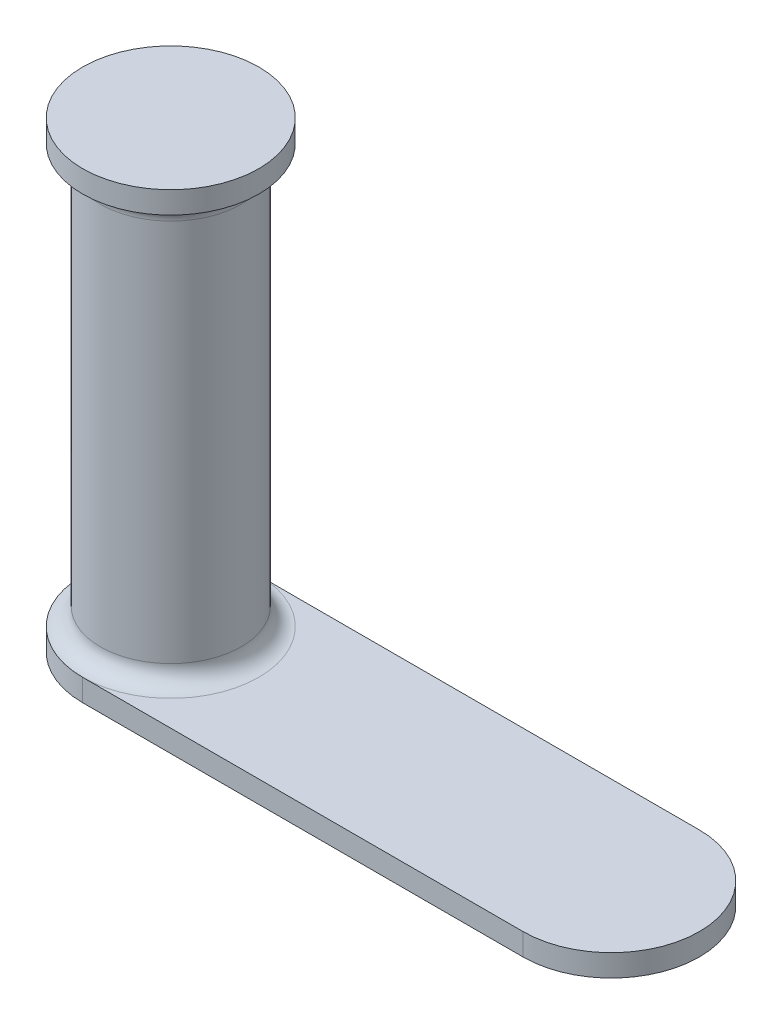
ISO-10303-21;
HEADER;
FILE_DESCRIPTION(('STEP AP214'),'2;1');
FILE_NAME('part.step','',(''),(''),'','','');
FILE_SCHEMA(('AUTOMOTIVE_DESIGN { 1 0 10303 214 1 1 1 1 }'));
ENDSEC;
DATA;
#1=APPLICATION_CONTEXT('core data for automotive mechanical design processes');
#2=APPLICATION_PROTOCOL_DEFINITION('international standard','automotive_design',2000,#1);
#3=PRODUCT_CONTEXT('',#1,'mechanical');
#4=PRODUCT('Part','Part','',(#3));
#5=PRODUCT_RELATED_PRODUCT_CATEGORY('part','',(#4));
#6=PRODUCT_DEFINITION_FORMATION('','',#4);
#7=PRODUCT_DEFINITION_CONTEXT('part definition',#1,'design');
#8=PRODUCT_DEFINITION('design','',#6,#7);
#9=PRODUCT_DEFINITION_SHAPE('','',#8);
#10=(LENGTH_UNIT() NAMED_UNIT(*) SI_UNIT(.MILLI.,.METRE.));
#11=(NAMED_UNIT(*) PLANE_ANGLE_UNIT() SI_UNIT($,.RADIAN.));
#12=(NAMED_UNIT(*) SI_UNIT($,.STERADIAN.) SOLID_ANGLE_UNIT());
#13=UNCERTAINTY_MEASURE_WITH_UNIT(LENGTH_MEASURE(1.E-05),#10,'distance_accuracy_value','');
#14=(GEOMETRIC_REPRESENTATION_CONTEXT(3) GLOBAL_UNCERTAINTY_ASSIGNED_CONTEXT((#13)) GLOBAL_UNIT_ASSIGNED_CONTEXT((#10,
#11,#12)) REPRESENTATION_CONTEXT('',''));
#15=CARTESIAN_POINT('',(0.,0.,0.));
#16=DIRECTION('',(0.,0.,1.));
#17=DIRECTION('',(1.,0.,0.));
#18=AXIS2_PLACEMENT_3D('',#15,#16,#17);
#19=CARTESIAN_POINT('',(0.,60.1846850325902,0.));
#20=DIRECTION('',(0.,-1.,0.));
#21=DIRECTION('',(1.,0.,0.));
#22=AXIS2_PLACEMENT_3D('',#19,#20,#21);
#23=PLANE('',#22);
#24=CARTESIAN_POINT('',(0.,60.1846850325902,0.));
#25=DIRECTION('',(0.,1.,0.));
#26=DIRECTION('',(-1.,0.,0.));
#27=AXIS2_PLACEMENT_3D('',#24,#25,#26);
#28=CIRCLE('',#27,20.);
#29=CARTESIAN_POINT('',(-20.,60.1846850325902,0.));
#30=VERTEX_POINT('',#29);
#31=EDGE_CURVE('E106',#30,#30,#28,.T.);
#32=ORIENTED_EDGE('',*,*,#31,.T.);
#33=EDGE_LOOP('',(#32));
#34=FACE_BOUND('',#33,.T.);
#35=ADVANCED_FACE('F31',(#34),#23,.F.);
#36=CARTESIAN_POINT('',(0.,-35.8153149674098,0.));
#37=DIRECTION('',(0.,1.,0.));
#38=DIRECTION('',(-1.,0.,0.));
#39=AXIS2_PLACEMENT_3D('',#36,#37,#38);
#40=TOROIDAL_SURFACE('',#39,20.,4.);
#41=CARTESIAN_POINT('',(0.,-35.8153149674098,0.));
#42=DIRECTION('',(0.,1.,0.));
#43=DIRECTION('',(-1.,0.,0.));
#44=AXIS2_PLACEMENT_3D('',#41,#42,#43);
#45=CIRCLE('',#44,16.);
#46=CARTESIAN_POINT('',(-16.,-35.8153149674098,0.));
#47=VERTEX_POINT('',#46);
#48=EDGE_CURVE('E38',#47,#47,#45,.T.);
#49=ORIENTED_EDGE('',*,*,#48,.F.);
#50=EDGE_LOOP('',(#49));
#51=FACE_BOUND('',#50,.T.);
#52=CARTESIAN_POINT('',(0.,-39.8153149674098,0.));
#53=DIRECTION('',(0.,1.,0.));
#54=DIRECTION('',(-1.,0.,0.));
#55=AXIS2_PLACEMENT_3D('',#52,#53,#54);
#56=CIRCLE('',#55,20.);
#57=CARTESIAN_POINT('',(0.,-39.8153149674098,20.));
#58=VERTEX_POINT('',#57);
#59=CARTESIAN_POINT('',(0.,-39.8153149674098,-20.));
#60=VERTEX_POINT('',#59);
#61=EDGE_CURVE('E11',#58,#60,#56,.T.);
#62=ORIENTED_EDGE('',*,*,#61,.T.);
#63=CARTESIAN_POINT('',(0.,-39.8153149674098,0.));
#64=DIRECTION('',(0.,-1.,0.));
#65=DIRECTION('',(1.,0.,0.));
#66=AXIS2_PLACEMENT_3D('',#63,#64,#65);
#67=CIRCLE('',#66,20.);
#68=EDGE_CURVE('E97',#58,#60,#67,.T.);
#69=ORIENTED_EDGE('',*,*,#68,.F.);
#70=EDGE_LOOP('',(#62,#69));
#71=FACE_BOUND('',#70,.T.);
#72=ADVANCED_FACE('F119',(#51,#71),#40,.F.);
#73=CARTESIAN_POINT('',(0.,60.1846850325902,0.));
#74=DIRECTION('',(0.,1.,0.));
#75=DIRECTION('',(-1.,0.,0.));
#76=AXIS2_PLACEMENT_3D('',#73,#74,#75);
#77=CYLINDRICAL_SURFACE('',#76,16.);
#78=CARTESIAN_POINT('',(0.,51.1846850325902,0.));
#79=DIRECTION('',(0.,1.,0.));
#80=DIRECTION('',(-1.,0.,0.));
#81=AXIS2_PLACEMENT_3D('',#78,#79,#80);
#82=CIRCLE('',#81,16.);
#83=CARTESIAN_POINT('',(-16.,51.1846850325902,0.));
#84=VERTEX_POINT('',#83);
#85=EDGE_CURVE('E112',#84,#84,#82,.T.);
#86=ORIENTED_EDGE('',*,*,#85,.F.);
#87=EDGE_LOOP('',(#86));
#88=FACE_BOUND('',#87,.T.);
#89=ORIENTED_EDGE('',*,*,#48,.T.);
#90=EDGE_LOOP('',(#89));
#91=FACE_BOUND('',#90,.T.);
#92=ADVANCED_FACE('F117',(#88,#91),#77,.T.);
#93=CARTESIAN_POINT('',(0.,51.1846850325902,0.));
#94=DIRECTION('',(0.,1.,0.));
#95=DIRECTION('',(-1.,0.,0.));
#96=AXIS2_PLACEMENT_3D('',#93,#94,#95);
#97=TOROIDAL_SURFACE('',#96,20.,4.);
#98=CARTESIAN_POINT('',(0.,55.1846850325902,0.));
#99=DIRECTION('',(0.,1.,0.));
#100=DIRECTION('',(-1.,0.,0.));
#101=AXIS2_PLACEMENT_3D('',#98,#99,#100);
#102=CIRCLE('',#101,20.);
#103=CARTESIAN_POINT('',(-20.,55.1846850325902,0.));
#104=VERTEX_POINT('',#103);
#105=EDGE_CURVE('E109',#104,#104,#102,.T.);
#106=ORIENTED_EDGE('',*,*,#105,.F.);
#107=EDGE_LOOP('',(#106));
#108=FACE_BOUND('',#107,.T.);
#109=ORIENTED_EDGE('',*,*,#85,.T.);
#110=EDGE_LOOP('',(#109));
#111=FACE_BOUND('',#110,.T.);
#112=ADVANCED_FACE('F146',(#108,#111),#97,.F.);
#113=CARTESIAN_POINT('',(0.,60.1846850325902,0.));
#114=DIRECTION('',(0.,1.,0.));
#115=DIRECTION('',(-1.,0.,0.));
#116=AXIS2_PLACEMENT_3D('',#113,#114,#115);
#117=CYLINDRICAL_SURFACE('',#116,20.);
#118=ORIENTED_EDGE('',*,*,#31,.F.);
#119=EDGE_LOOP('',(#118));
#120=FACE_BOUND('',#119,.T.);
#121=ORIENTED_EDGE('',*,*,#105,.T.);
#122=EDGE_LOOP('',(#121));
#123=FACE_BOUND('',#122,.T.);
#124=ADVANCED_FACE('F135',(#120,#123),#117,.T.);
#125=CARTESIAN_POINT('',(0.,-39.8153149674098,0.));
#126=DIRECTION('',(0.,-1.,0.));
#127=DIRECTION('',(1.,0.,0.));
#128=AXIS2_PLACEMENT_3D('',#125,#126,#127);
#129=PLANE('',#128);
#130=DIRECTION('',(1.,0.,0.));
#131=VECTOR('',#130,1.);
#132=CARTESIAN_POINT('',(0.,-39.8153149674098,-20.));
#133=LINE('',#132,#131);
#134=CARTESIAN_POINT('',(100.,-39.8153149674098,-20.));
#135=VERTEX_POINT('',#134);
#136=EDGE_CURVE('E88',#60,#135,#133,.T.);
#137=ORIENTED_EDGE('',*,*,#136,.F.);
#138=ORIENTED_EDGE('',*,*,#61,.F.);
#139=DIRECTION('',(-1.,0.,0.));
#140=VECTOR('',#139,1.);
#141=CARTESIAN_POINT('',(100.,-39.8153149674098,20.));
#142=LINE('',#141,#140);
#143=CARTESIAN_POINT('',(100.,-39.8153149674098,20.));
#144=VERTEX_POINT('',#143);
#145=EDGE_CURVE('E101',#144,#58,#142,.T.);
#146=ORIENTED_EDGE('',*,*,#145,.F.);
#147=CARTESIAN_POINT('',(100.,-39.8153149674098,0.));
#148=DIRECTION('',(0.,-1.,0.));
#149=DIRECTION('',(1.,0.,0.));
#150=AXIS2_PLACEMENT_3D('',#147,#148,#149);
#151=CIRCLE('',#150,20.);
#152=EDGE_CURVE('E71',#135,#144,#151,.T.);
#153=ORIENTED_EDGE('',*,*,#152,.F.);
#154=EDGE_LOOP('',(#137,#138,#146,#153));
#155=FACE_BOUND('',#154,.T.);
#156=ADVANCED_FACE('F126',(#155),#129,.F.);
#157=CARTESIAN_POINT('',(0.,-44.8153149674098,0.));
#158=DIRECTION('',(0.,1.,0.));
#159=DIRECTION('',(-1.,0.,0.));
#160=AXIS2_PLACEMENT_3D('',#157,#158,#159);
#161=CYLINDRICAL_SURFACE('',#160,20.);
#162=ORIENTED_EDGE('',*,*,#68,.T.);
#163=DIRECTION('',(0.,1.,0.));
#164=VECTOR('',#163,1.);
#165=CARTESIAN_POINT('',(0.,-44.8153149674098,-20.));
#166=LINE('',#165,#164);
#167=CARTESIAN_POINT('',(0.,-44.8153149674098,-20.));
#168=VERTEX_POINT('',#167);
#169=EDGE_CURVE('E89',#168,#60,#166,.T.);
#170=ORIENTED_EDGE('',*,*,#169,.F.);
#171=CARTESIAN_POINT('',(0.,-44.8153149674098,0.));
#172=DIRECTION('',(0.,-1.,0.));
#173=DIRECTION('',(1.,0.,0.));
#174=AXIS2_PLACEMENT_3D('',#171,#172,#173);
#175=CIRCLE('',#174,20.);
#176=CARTESIAN_POINT('',(0.,-44.8153149674098,20.));
#177=VERTEX_POINT('',#176);
#178=EDGE_CURVE('E83',#177,#168,#175,.T.);
#179=ORIENTED_EDGE('',*,*,#178,.F.);
#180=DIRECTION('',(0.,1.,0.));
#181=VECTOR('',#180,1.);
#182=CARTESIAN_POINT('',(0.,-44.8153149674098,20.));
#183=LINE('',#182,#181);
#184=EDGE_CURVE('E45',#177,#58,#183,.T.);
#185=ORIENTED_EDGE('',*,*,#184,.T.);
#186=EDGE_LOOP('',(#162,#170,#179,#185));
#187=FACE_BOUND('',#186,.T.);
#188=ADVANCED_FACE('F127',(#187),#161,.T.);
#189=CARTESIAN_POINT('',(0.,-44.8153149674098,-20.));
#190=DIRECTION('',(0.,0.,1.));
#191=DIRECTION('',(1.,0.,0.));
#192=AXIS2_PLACEMENT_3D('',#189,#190,#191);
#193=PLANE('',#192);
#194=ORIENTED_EDGE('',*,*,#136,.T.);
#195=DIRECTION('',(0.,1.,0.));
#196=VECTOR('',#195,1.);
#197=CARTESIAN_POINT('',(100.,-44.8153149674098,-20.));
#198=LINE('',#197,#196);
#199=CARTESIAN_POINT('',(100.,-44.8153149674098,-20.));
#200=VERTEX_POINT('',#199);
#201=EDGE_CURVE('E86',#200,#135,#198,.T.);
#202=ORIENTED_EDGE('',*,*,#201,.F.);
#203=DIRECTION('',(1.,0.,0.));
#204=VECTOR('',#203,1.);
#205=CARTESIAN_POINT('',(0.,-44.8153149674098,-20.));
#206=LINE('',#205,#204);
#207=EDGE_CURVE('E79',#168,#200,#206,.T.);
#208=ORIENTED_EDGE('',*,*,#207,.F.);
#209=ORIENTED_EDGE('',*,*,#169,.T.);
#210=EDGE_LOOP('',(#194,#202,#208,#209));
#211=FACE_BOUND('',#210,.T.);
#212=ADVANCED_FACE('F87',(#211),#193,.F.);
#213=CARTESIAN_POINT('',(100.,-44.8153149674098,0.));
#214=DIRECTION('',(0.,1.,0.));
#215=DIRECTION('',(-1.,0.,0.));
#216=AXIS2_PLACEMENT_3D('',#213,#214,#215);
#217=CYLINDRICAL_SURFACE('',#216,20.);
#218=ORIENTED_EDGE('',*,*,#152,.T.);
#219=DIRECTION('',(0.,1.,0.));
#220=VECTOR('',#219,1.);
#221=CARTESIAN_POINT('',(100.,-44.8153149674098,20.));
#222=LINE('',#221,#220);
#223=CARTESIAN_POINT('',(100.,-44.8153149674098,20.));
#224=VERTEX_POINT('',#223);
#225=EDGE_CURVE('E90',#224,#144,#222,.T.);
#226=ORIENTED_EDGE('',*,*,#225,.F.);
#227=CARTESIAN_POINT('',(100.,-44.8153149674098,0.));
#228=DIRECTION('',(0.,-1.,0.));
#229=DIRECTION('',(1.,0.,0.));
#230=AXIS2_PLACEMENT_3D('',#227,#228,#229);
#231=CIRCLE('',#230,20.);
#232=EDGE_CURVE('E82',#200,#224,#231,.T.);
#233=ORIENTED_EDGE('',*,*,#232,.F.);
#234=ORIENTED_EDGE('',*,*,#201,.T.);
#235=EDGE_LOOP('',(#218,#226,#233,#234));
#236=FACE_BOUND('',#235,.T.);
#237=ADVANCED_FACE('F92',(#236),#217,.T.);
#238=CARTESIAN_POINT('',(100.,-44.8153149674098,20.));
#239=DIRECTION('',(0.,0.,-1.));
#240=DIRECTION('',(-1.,0.,0.));
#241=AXIS2_PLACEMENT_3D('',#238,#239,#240);
#242=PLANE('',#241);
#243=ORIENTED_EDGE('',*,*,#145,.T.);
#244=ORIENTED_EDGE('',*,*,#184,.F.);
#245=DIRECTION('',(-1.,0.,0.));
#246=VECTOR('',#245,1.);
#247=CARTESIAN_POINT('',(100.,-44.8153149674098,20.));
#248=LINE('',#247,#246);
#249=EDGE_CURVE('E54',#224,#177,#248,.T.);
#250=ORIENTED_EDGE('',*,*,#249,.F.);
#251=ORIENTED_EDGE('',*,*,#225,.T.);
#252=EDGE_LOOP('',(#243,#244,#250,#251));
#253=FACE_BOUND('',#252,.T.);
#254=ADVANCED_FACE('F193',(#253),#242,.F.);
#255=CARTESIAN_POINT('',(0.,-44.8153149674098,0.));
#256=DIRECTION('',(0.,-1.,0.));
#257=DIRECTION('',(1.,0.,0.));
#258=AXIS2_PLACEMENT_3D('',#255,#256,#257);
#259=PLANE('',#258);
#260=ORIENTED_EDGE('',*,*,#178,.T.);
#261=ORIENTED_EDGE('',*,*,#207,.T.);
#262=ORIENTED_EDGE('',*,*,#232,.T.);
#263=ORIENTED_EDGE('',*,*,#249,.T.);
#264=EDGE_LOOP('',(#260,#261,#262,#263));
#265=FACE_BOUND('',#264,.T.);
#266=ADVANCED_FACE('F80',(#265),#259,.T.);
#267=CLOSED_SHELL('',(#35,#72,#92,#112,#124,#156,#188,#212,#237,#254,#266));
#268=MANIFOLD_SOLID_BREP('B2',#267);
#269=ADVANCED_BREP_SHAPE_REPRESENTATION('',(#18,#268),#14);
#270=SHAPE_DEFINITION_REPRESENTATION(#9,#269);
ENDSEC;
END-ISO-10303-21;
